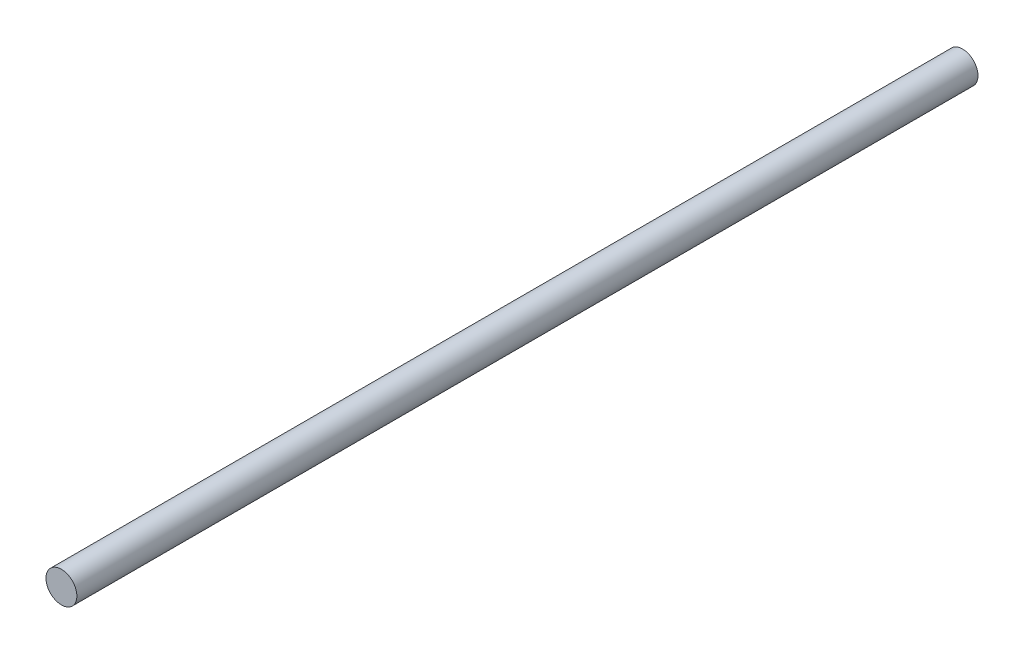
ISO-10303-21;
HEADER;
FILE_DESCRIPTION(('STEP AP214'),'2;1');
FILE_NAME('part.step','',(''),(''),'','','');
FILE_SCHEMA(('AUTOMOTIVE_DESIGN { 1 0 10303 214 1 1 1 1 }'));
ENDSEC;
DATA;
#1=APPLICATION_CONTEXT('core data for automotive mechanical design processes');
#2=APPLICATION_PROTOCOL_DEFINITION('international standard','automotive_design',2000,#1);
#3=PRODUCT_CONTEXT('',#1,'mechanical');
#4=PRODUCT('Part','Part','',(#3));
#5=PRODUCT_RELATED_PRODUCT_CATEGORY('part','',(#4));
#6=PRODUCT_DEFINITION_FORMATION('','',#4);
#7=PRODUCT_DEFINITION_CONTEXT('part definition',#1,'design');
#8=PRODUCT_DEFINITION('design','',#6,#7);
#9=PRODUCT_DEFINITION_SHAPE('','',#8);
#10=(LENGTH_UNIT() NAMED_UNIT(*) SI_UNIT(.MILLI.,.METRE.));
#11=(NAMED_UNIT(*) PLANE_ANGLE_UNIT() SI_UNIT($,.RADIAN.));
#12=(NAMED_UNIT(*) SI_UNIT($,.STERADIAN.) SOLID_ANGLE_UNIT());
#13=UNCERTAINTY_MEASURE_WITH_UNIT(LENGTH_MEASURE(1.E-05),#10,'distance_accuracy_value','');
#14=(GEOMETRIC_REPRESENTATION_CONTEXT(3) GLOBAL_UNCERTAINTY_ASSIGNED_CONTEXT((#13)) GLOBAL_UNIT_ASSIGNED_CONTEXT((#10,
#11,#12)) REPRESENTATION_CONTEXT('',''));
#15=CARTESIAN_POINT('',(0.,0.,0.));
#16=DIRECTION('',(0.,0.,1.));
#17=DIRECTION('',(1.,0.,0.));
#18=AXIS2_PLACEMENT_3D('',#15,#16,#17);
#19=CARTESIAN_POINT('',(0.,0.,350.));
#20=DIRECTION('',(0.,0.,-1.));
#21=DIRECTION('',(-1.,0.,0.));
#22=AXIS2_PLACEMENT_3D('',#19,#20,#21);
#23=CYLINDRICAL_SURFACE('',#22,6.);
#24=CARTESIAN_POINT('',(0.,0.,350.));
#25=DIRECTION('',(0.,0.,1.));
#26=DIRECTION('',(1.,0.,0.));
#27=AXIS2_PLACEMENT_3D('',#24,#25,#26);
#28=CIRCLE('',#27,6.);
#29=CARTESIAN_POINT('',(6.,0.,350.));
#30=VERTEX_POINT('',#29);
#31=EDGE_CURVE('E10',#30,#30,#28,.T.);
#32=ORIENTED_EDGE('',*,*,#31,.F.);
#33=EDGE_LOOP('',(#32));
#34=FACE_BOUND('',#33,.T.);
#35=CARTESIAN_POINT('',(0.,0.,0.));
#36=DIRECTION('',(0.,0.,1.));
#37=DIRECTION('',(1.,0.,0.));
#38=AXIS2_PLACEMENT_3D('',#35,#36,#37);
#39=CIRCLE('',#38,6.);
#40=CARTESIAN_POINT('',(6.,0.,0.));
#41=VERTEX_POINT('',#40);
#42=EDGE_CURVE('E35',#41,#41,#39,.T.);
#43=ORIENTED_EDGE('',*,*,#42,.T.);
#44=EDGE_LOOP('',(#43));
#45=FACE_BOUND('',#44,.T.);
#46=ADVANCED_FACE('F32',(#34,#45),#23,.T.);
#47=CARTESIAN_POINT('',(0.,0.,350.));
#48=DIRECTION('',(0.,0.,1.));
#49=DIRECTION('',(1.,0.,0.));
#50=AXIS2_PLACEMENT_3D('',#47,#48,#49);
#51=PLANE('',#50);
#52=ORIENTED_EDGE('',*,*,#31,.T.);
#53=EDGE_LOOP('',(#52));
#54=FACE_BOUND('',#53,.T.);
#55=ADVANCED_FACE('F47',(#54),#51,.T.);
#56=CARTESIAN_POINT('',(0.,0.,0.));
#57=DIRECTION('',(0.,0.,1.));
#58=DIRECTION('',(1.,0.,0.));
#59=AXIS2_PLACEMENT_3D('',#56,#57,#58);
#60=PLANE('',#59);
#61=ORIENTED_EDGE('',*,*,#42,.F.);
#62=EDGE_LOOP('',(#61));
#63=FACE_BOUND('',#62,.T.);
#64=ADVANCED_FACE('F45',(#63),#60,.F.);
#65=CLOSED_SHELL('',(#46,#55,#64));
#66=MANIFOLD_SOLID_BREP('B2',#65);
#67=ADVANCED_BREP_SHAPE_REPRESENTATION('',(#18,#66),#14);
#68=SHAPE_DEFINITION_REPRESENTATION(#9,#67);
ENDSEC;
END-ISO-10303-21;
